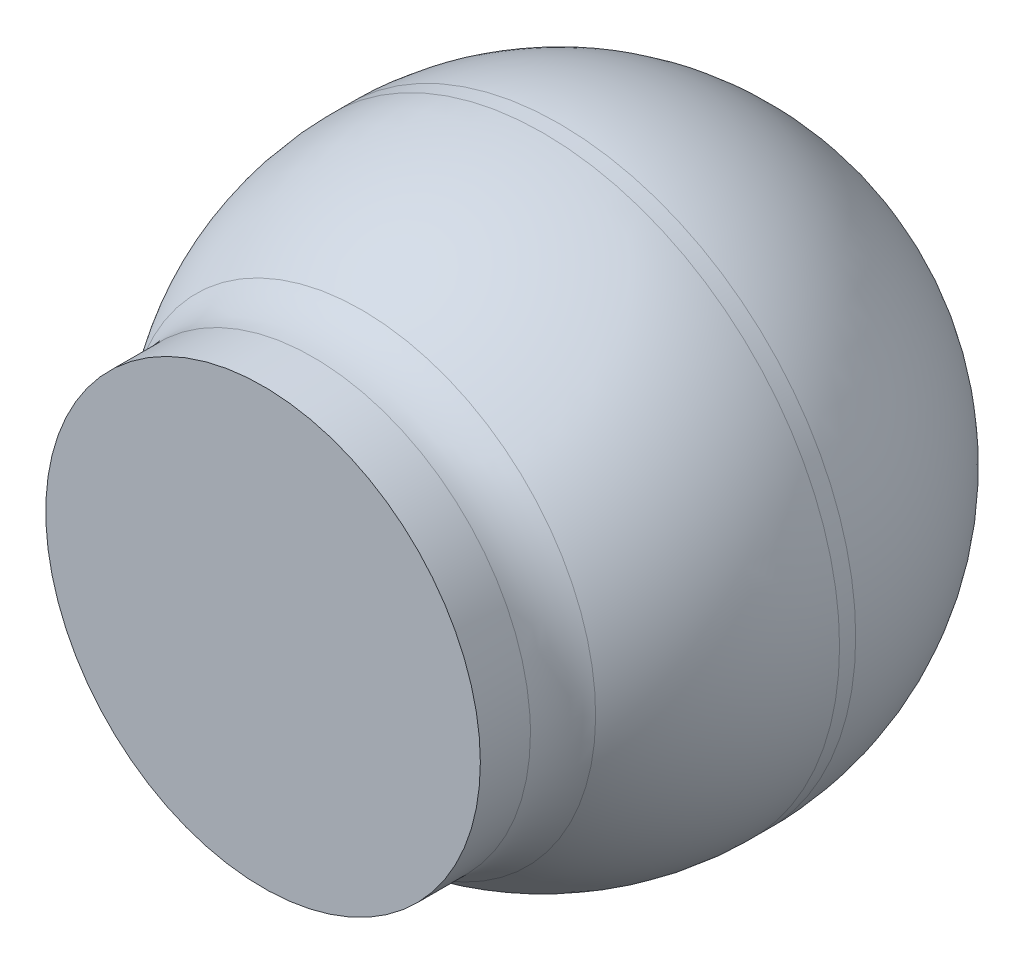
ISO-10303-21;
HEADER;
FILE_DESCRIPTION(('STEP AP214'),'2;1');
FILE_NAME('part.step','',(''),(''),'','','');
FILE_SCHEMA(('AUTOMOTIVE_DESIGN { 1 0 10303 214 1 1 1 1 }'));
ENDSEC;
DATA;
#1=APPLICATION_CONTEXT('core data for automotive mechanical design processes');
#2=APPLICATION_PROTOCOL_DEFINITION('international standard','automotive_design',2000,#1);
#3=PRODUCT_CONTEXT('',#1,'mechanical');
#4=PRODUCT('Part','Part','',(#3));
#5=PRODUCT_RELATED_PRODUCT_CATEGORY('part','',(#4));
#6=PRODUCT_DEFINITION_FORMATION('','',#4);
#7=PRODUCT_DEFINITION_CONTEXT('part definition',#1,'design');
#8=PRODUCT_DEFINITION('design','',#6,#7);
#9=PRODUCT_DEFINITION_SHAPE('','',#8);
#10=(LENGTH_UNIT() NAMED_UNIT(*) SI_UNIT(.MILLI.,.METRE.));
#11=(NAMED_UNIT(*) PLANE_ANGLE_UNIT() SI_UNIT($,.RADIAN.));
#12=(NAMED_UNIT(*) SI_UNIT($,.STERADIAN.) SOLID_ANGLE_UNIT());
#13=UNCERTAINTY_MEASURE_WITH_UNIT(LENGTH_MEASURE(1.E-05),#10,'distance_accuracy_value','');
#14=(GEOMETRIC_REPRESENTATION_CONTEXT(3) GLOBAL_UNCERTAINTY_ASSIGNED_CONTEXT((#13)) GLOBAL_UNIT_ASSIGNED_CONTEXT((#10,
#11,#12)) REPRESENTATION_CONTEXT('',''));
#15=CARTESIAN_POINT('',(0.,0.,0.));
#16=DIRECTION('',(0.,0.,1.));
#17=DIRECTION('',(1.,0.,0.));
#18=AXIS2_PLACEMENT_3D('',#15,#16,#17);
#19=CARTESIAN_POINT('',(-4.372919922269,-4.051349291452,10.006534503384));
#20=DIRECTION('',(0.,0.,-1.));
#21=DIRECTION('',(-1.,0.,0.));
#22=AXIS2_PLACEMENT_3D('',#19,#20,#21);
#23=PLANE('',#22);
#24=CARTESIAN_POINT('',(-4.372919922269,-4.051349291452,10.006534503384));
#25=DIRECTION('',(0.,0.,1.));
#26=DIRECTION('',(1.,0.,0.));
#27=AXIS2_PLACEMENT_3D('',#24,#25,#26);
#28=CIRCLE('',#27,0.275);
#29=CARTESIAN_POINT('',(-4.097919922269,-4.051349291452,10.006534503384));
#30=VERTEX_POINT('',#29);
#31=EDGE_CURVE('E20',#30,#30,#28,.F.);
#32=ORIENTED_EDGE('',*,*,#31,.F.);
#33=EDGE_LOOP('',(#32));
#34=FACE_BOUND('',#33,.T.);
#35=ADVANCED_FACE('F17',(#34),#23,.F.);
#36=CARTESIAN_POINT('',(-4.372919922269,-4.051349291452,9.906534503384));
#37=DIRECTION('',(0.,0.,1.));
#38=DIRECTION('',(1.,0.,0.));
#39=AXIS2_PLACEMENT_3D('',#36,#37,#38);
#40=CYLINDRICAL_SURFACE('',#39,0.275);
#41=CARTESIAN_POINT('',(-4.372919922269,-4.051349291452,9.943180457728));
#42=DIRECTION('',(0.,0.,-1.));
#43=DIRECTION('',(0.996700902337583,0.0811622527992439,0.));
#44=AXIS2_PLACEMENT_3D('',#41,#42,#43);
#45=CIRCLE('',#44,0.275);
#46=CARTESIAN_POINT('',(-4.09882717412617,-4.02902967193221,9.943180457728));
#47=VERTEX_POINT('',#46);
#48=EDGE_CURVE('E65',#47,#47,#45,.F.);
#49=ORIENTED_EDGE('',*,*,#48,.T.);
#50=EDGE_LOOP('',(#49));
#51=FACE_BOUND('',#50,.T.);
#52=ORIENTED_EDGE('',*,*,#31,.T.);
#53=EDGE_LOOP('',(#52));
#54=FACE_BOUND('',#53,.T.);
#55=ADVANCED_FACE('F62',(#51,#54),#40,.T.);
#56=CARTESIAN_POINT('',(-4.372919922269,-4.051349291452,9.943180457728));
#57=DIRECTION('',(0.,0.,-1.));
#58=DIRECTION('',(0.996700902337583,0.0811622527992448,0.));
#59=AXIS2_PLACEMENT_3D('',#56,#57,#58);
#60=TOROIDAL_SURFACE('',#59,0.375,0.1);
#61=ORIENTED_EDGE('',*,*,#48,.F.);
#62=EDGE_LOOP('',(#61));
#63=FACE_BOUND('',#62,.T.);
#64=CARTESIAN_POINT('',(-4.372919922269,-4.051349291452,9.881744931236));
#65=DIRECTION('',(0.,0.,-1.));
#66=DIRECTION('',(-0.996700902337598,-0.0811622527990593,0.));
#67=AXIS2_PLACEMENT_3D('',#64,#65,#66);
#68=CIRCLE('',#67,0.296097046412665);
#69=CARTESIAN_POINT('',(-4.668040115608,-4.075381194786,9.881744931236));
#70=VERTEX_POINT('',#69);
#71=EDGE_CURVE('E39',#70,#70,#68,.T.);
#72=ORIENTED_EDGE('',*,*,#71,.F.);
#73=EDGE_LOOP('',(#72));
#74=FACE_BOUND('',#73,.T.);
#75=ADVANCED_FACE('F57',(#63,#74),#60,.F.);
#76=CARTESIAN_POINT('',(-4.746682760645,-4.081785136252,9.651976062157));
#77=CARTESIAN_POINT('',(-4.746682760645,-4.081785136252,9.701461392103));
#78=CARTESIAN_POINT('',(-4.738526217348,-4.081120941579,9.750947004335));
#79=CARTESIAN_POINT('',(-4.722207085349,-4.079792059952,9.798626332798));
#80=CARTESIAN_POINT('',(-4.698341390838,-4.077848654938,9.842699544317));
#81=CARTESIAN_POINT('',(-4.668040115608,-4.075381194786,9.881744931236));
#82=(BOUNDED_CURVE() B_SPLINE_CURVE(5,(#76,#77,#78,#79,#80,#81),.UNSPECIFIED.,.F.,
.F.) B_SPLINE_CURVE_WITH_KNOTS((6,6),(0.,0.661568582165),
.UNSPECIFIED.) CURVE() GEOMETRIC_REPRESENTATION_ITEM() RATIONAL_B_SPLINE_CURVE((1.,1.,1.,1.,1.,1.)) REPRESENTATION_ITEM(''));
#83=CARTESIAN_POINT('',(-4.372919922269,-4.051349291452,9.651976062157));
#84=DIRECTION('',(0.,0.,-1.));
#85=AXIS1_PLACEMENT('',#83,#84);
#86=SURFACE_OF_REVOLUTION('',#82,#85);
#87=CARTESIAN_POINT('',(-4.372919922269,-4.051349291452,9.651976062157));
#88=DIRECTION('',(0.,0.,1.));
#89=DIRECTION('',(1.,0.,0.));
#90=AXIS2_PLACEMENT_3D('',#87,#88,#89);
#91=CIRCLE('',#90,0.375);
#92=CARTESIAN_POINT('',(-3.997919922269,-4.051349291452,9.651976062157));
#93=VERTEX_POINT('',#92);
#94=EDGE_CURVE('E36',#93,#93,#91,.F.);
#95=ORIENTED_EDGE('',*,*,#94,.F.);
#96=EDGE_LOOP('',(#95));
#97=FACE_BOUND('',#96,.T.);
#98=ORIENTED_EDGE('',*,*,#71,.T.);
#99=EDGE_LOOP('',(#98));
#100=FACE_BOUND('',#99,.T.);
#101=ADVANCED_FACE('F53',(#97,#100),#86,.F.);
#102=CARTESIAN_POINT('',(-4.372919922269,-4.051349291452,9.256534503384));
#103=DIRECTION('',(0.,0.,1.));
#104=DIRECTION('',(1.,0.,0.));
#105=AXIS2_PLACEMENT_3D('',#102,#103,#104);
#106=CYLINDRICAL_SURFACE('',#105,0.375);
#107=CARTESIAN_POINT('',(-4.372919922269,-4.051349291452,9.631534503384));
#108=DIRECTION('',(0.,0.,-1.));
#109=DIRECTION('',(0.0811622527992357,-0.996700902337583,0.));
#110=AXIS2_PLACEMENT_3D('',#107,#108,#109);
#111=CIRCLE('',#110,0.375);
#112=CARTESIAN_POINT('',(-4.34248407746929,-4.42511212982859,9.631534503384));
#113=VERTEX_POINT('',#112);
#114=CARTESIAN_POINT('',(-4.40335576706871,-3.67758645307541,9.631534503384));
#115=VERTEX_POINT('',#114);
#116=EDGE_CURVE('E11',#113,#115,#111,.T.);
#117=ORIENTED_EDGE('',*,*,#116,.F.);
#118=CARTESIAN_POINT('',(-4.372919922269,-4.051349291452,9.631534503384));
#119=DIRECTION('',(0.,0.,1.));
#120=DIRECTION('',(0.0811622527992365,-0.996700902337583,0.));
#121=AXIS2_PLACEMENT_3D('',#118,#119,#120);
#122=CIRCLE('',#121,0.375);
#123=EDGE_CURVE('E25',#115,#113,#122,.F.);
#124=ORIENTED_EDGE('',*,*,#123,.F.);
#125=EDGE_LOOP('',(#117,#124));
#126=FACE_BOUND('',#125,.T.);
#127=ORIENTED_EDGE('',*,*,#94,.T.);
#128=EDGE_LOOP('',(#127));
#129=FACE_BOUND('',#128,.T.);
#130=ADVANCED_FACE('F34',(#126,#129),#106,.T.);
#131=CARTESIAN_POINT('',(-4.372919922269,-4.051349291452,9.631534503384));
#132=DIRECTION('',(0.0811622527992361,-0.996700902337583,0.));
#133=DIRECTION('',(-0.996700902337583,-0.0811622527992361,0.));
#134=AXIS2_PLACEMENT_3D('',#131,#132,#133);
#135=SPHERICAL_SURFACE('',#134,0.375);
#136=ORIENTED_EDGE('',*,*,#123,.T.);
#137=ORIENTED_EDGE('',*,*,#116,.T.);
#138=EDGE_LOOP('',(#136,#137));
#139=FACE_BOUND('',#138,.T.);
#140=ADVANCED_FACE('F32',(#139),#135,.T.);
#141=CLOSED_SHELL('',(#35,#55,#75,#101,#130,#140));
#142=MANIFOLD_SOLID_BREP('B1',#141);
#143=ADVANCED_BREP_SHAPE_REPRESENTATION('',(#18,#142),#14);
#144=SHAPE_DEFINITION_REPRESENTATION(#9,#143);
ENDSEC;
END-ISO-10303-21;
